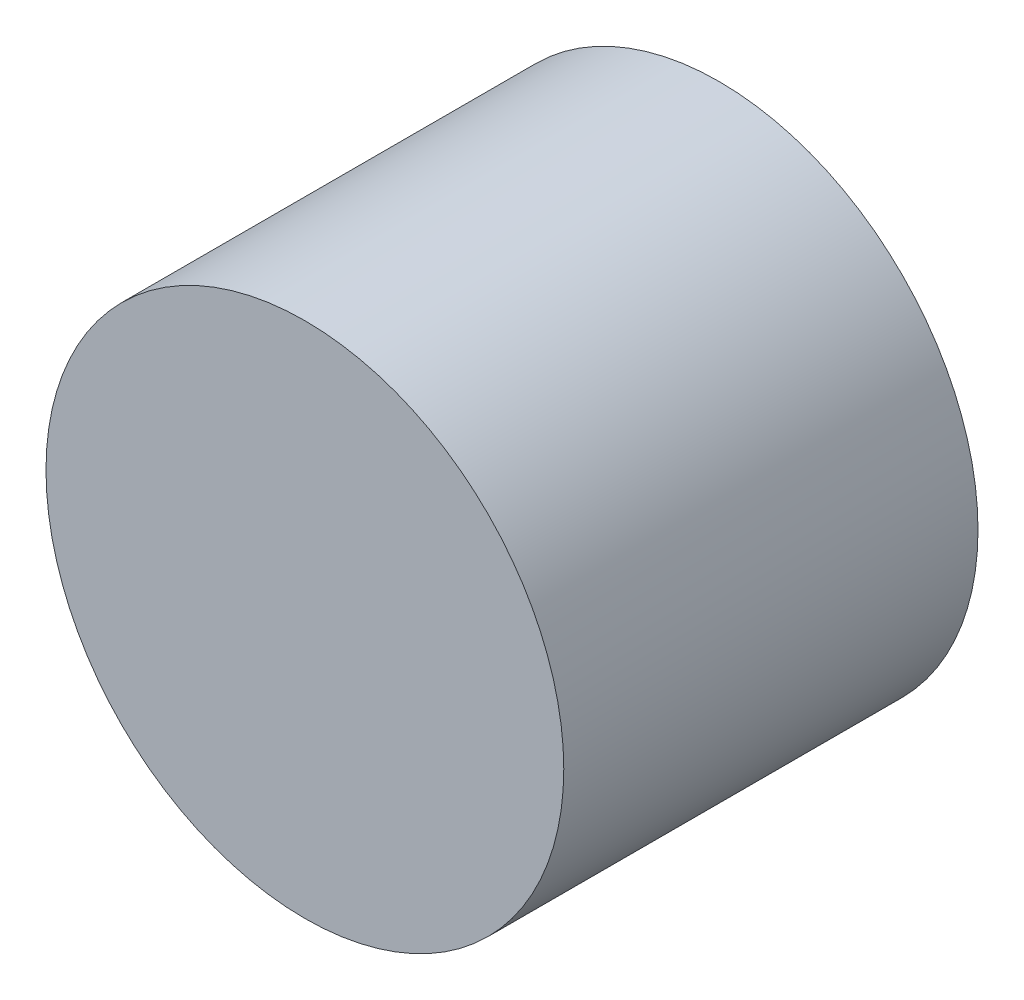
ISO-10303-21;
HEADER;
FILE_DESCRIPTION(('STEP AP214'),'2;1');
FILE_NAME('part.step','',(''),(''),'','','');
FILE_SCHEMA(('AUTOMOTIVE_DESIGN { 1 0 10303 214 1 1 1 1 }'));
ENDSEC;
DATA;
#1=APPLICATION_CONTEXT('core data for automotive mechanical design processes');
#2=APPLICATION_PROTOCOL_DEFINITION('international standard','automotive_design',2000,#1);
#3=PRODUCT_CONTEXT('',#1,'mechanical');
#4=PRODUCT('Part','Part','',(#3));
#5=PRODUCT_RELATED_PRODUCT_CATEGORY('part','',(#4));
#6=PRODUCT_DEFINITION_FORMATION('','',#4);
#7=PRODUCT_DEFINITION_CONTEXT('part definition',#1,'design');
#8=PRODUCT_DEFINITION('design','',#6,#7);
#9=PRODUCT_DEFINITION_SHAPE('','',#8);
#10=(LENGTH_UNIT() NAMED_UNIT(*) SI_UNIT(.MILLI.,.METRE.));
#11=(NAMED_UNIT(*) PLANE_ANGLE_UNIT() SI_UNIT($,.RADIAN.));
#12=(NAMED_UNIT(*) SI_UNIT($,.STERADIAN.) SOLID_ANGLE_UNIT());
#13=UNCERTAINTY_MEASURE_WITH_UNIT(LENGTH_MEASURE(1.E-05),#10,'distance_accuracy_value','');
#14=(GEOMETRIC_REPRESENTATION_CONTEXT(3) GLOBAL_UNCERTAINTY_ASSIGNED_CONTEXT((#13)) GLOBAL_UNIT_ASSIGNED_CONTEXT((#10,
#11,#12)) REPRESENTATION_CONTEXT('',''));
#15=CARTESIAN_POINT('',(0.,0.,0.));
#16=DIRECTION('',(0.,0.,1.));
#17=DIRECTION('',(1.,0.,0.));
#18=AXIS2_PLACEMENT_3D('',#15,#16,#17);
#19=CARTESIAN_POINT('',(0.,0.,4.));
#20=DIRECTION('',(0.,0.,-1.));
#21=DIRECTION('',(-1.,0.,0.));
#22=AXIS2_PLACEMENT_3D('',#19,#20,#21);
#23=CYLINDRICAL_SURFACE('',#22,2.5);
#24=CARTESIAN_POINT('',(0.,0.,4.));
#25=DIRECTION('',(0.,0.,1.));
#26=DIRECTION('',(1.,0.,0.));
#27=AXIS2_PLACEMENT_3D('',#24,#25,#26);
#28=CIRCLE('',#27,2.5);
#29=CARTESIAN_POINT('',(2.5,0.,4.));
#30=VERTEX_POINT('',#29);
#31=EDGE_CURVE('E10',#30,#30,#28,.T.);
#32=ORIENTED_EDGE('',*,*,#31,.F.);
#33=EDGE_LOOP('',(#32));
#34=FACE_BOUND('',#33,.T.);
#35=CARTESIAN_POINT('',(0.,0.,0.));
#36=DIRECTION('',(0.,0.,1.));
#37=DIRECTION('',(1.,0.,0.));
#38=AXIS2_PLACEMENT_3D('',#35,#36,#37);
#39=CIRCLE('',#38,2.5);
#40=CARTESIAN_POINT('',(2.5,0.,0.));
#41=VERTEX_POINT('',#40);
#42=EDGE_CURVE('E35',#41,#41,#39,.T.);
#43=ORIENTED_EDGE('',*,*,#42,.T.);
#44=EDGE_LOOP('',(#43));
#45=FACE_BOUND('',#44,.T.);
#46=ADVANCED_FACE('F32',(#34,#45),#23,.T.);
#47=CARTESIAN_POINT('',(0.,0.,4.));
#48=DIRECTION('',(0.,0.,1.));
#49=DIRECTION('',(1.,0.,0.));
#50=AXIS2_PLACEMENT_3D('',#47,#48,#49);
#51=PLANE('',#50);
#52=ORIENTED_EDGE('',*,*,#31,.T.);
#53=EDGE_LOOP('',(#52));
#54=FACE_BOUND('',#53,.T.);
#55=ADVANCED_FACE('F47',(#54),#51,.T.);
#56=CARTESIAN_POINT('',(0.,0.,0.));
#57=DIRECTION('',(0.,0.,1.));
#58=DIRECTION('',(1.,0.,0.));
#59=AXIS2_PLACEMENT_3D('',#56,#57,#58);
#60=PLANE('',#59);
#61=ORIENTED_EDGE('',*,*,#42,.F.);
#62=EDGE_LOOP('',(#61));
#63=FACE_BOUND('',#62,.T.);
#64=ADVANCED_FACE('F45',(#63),#60,.F.);
#65=CLOSED_SHELL('',(#46,#55,#64));
#66=MANIFOLD_SOLID_BREP('B2',#65);
#67=ADVANCED_BREP_SHAPE_REPRESENTATION('',(#18,#66),#14);
#68=SHAPE_DEFINITION_REPRESENTATION(#9,#67);
ENDSEC;
END-ISO-10303-21;
